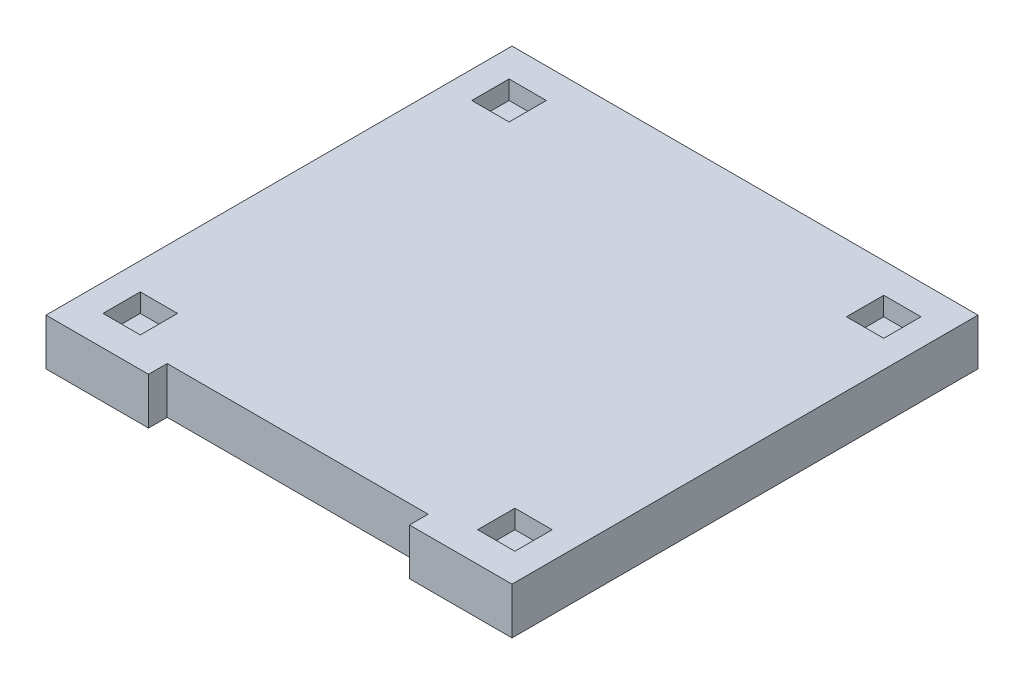
ISO-10303-21;
HEADER;
FILE_DESCRIPTION(('STEP AP214'),'2;1');
FILE_NAME('part.step','',(''),(''),'','','');
FILE_SCHEMA(('AUTOMOTIVE_DESIGN { 1 0 10303 214 1 1 1 1 }'));
ENDSEC;
DATA;
#1=APPLICATION_CONTEXT('core data for automotive mechanical design processes');
#2=APPLICATION_PROTOCOL_DEFINITION('international standard','automotive_design',2000,#1);
#3=PRODUCT_CONTEXT('',#1,'mechanical');
#4=PRODUCT('Part','Part','',(#3));
#5=PRODUCT_RELATED_PRODUCT_CATEGORY('part','',(#4));
#6=PRODUCT_DEFINITION_FORMATION('','',#4);
#7=PRODUCT_DEFINITION_CONTEXT('part definition',#1,'design');
#8=PRODUCT_DEFINITION('design','',#6,#7);
#9=PRODUCT_DEFINITION_SHAPE('','',#8);
#10=(LENGTH_UNIT() NAMED_UNIT(*) SI_UNIT(.MILLI.,.METRE.));
#11=(NAMED_UNIT(*) PLANE_ANGLE_UNIT() SI_UNIT($,.RADIAN.));
#12=(NAMED_UNIT(*) SI_UNIT($,.STERADIAN.) SOLID_ANGLE_UNIT());
#13=UNCERTAINTY_MEASURE_WITH_UNIT(LENGTH_MEASURE(1.E-05),#10,'distance_accuracy_value','');
#14=(GEOMETRIC_REPRESENTATION_CONTEXT(3) GLOBAL_UNCERTAINTY_ASSIGNED_CONTEXT((#13)) GLOBAL_UNIT_ASSIGNED_CONTEXT((#10,
#11,#12)) REPRESENTATION_CONTEXT('',''));
#15=CARTESIAN_POINT('',(0.,0.,0.));
#16=DIRECTION('',(0.,0.,1.));
#17=DIRECTION('',(1.,0.,0.));
#18=AXIS2_PLACEMENT_3D('',#15,#16,#17);
#19=CARTESIAN_POINT('',(-1249.99999999995,250.,1250.00000000003));
#20=DIRECTION('',(0.,0.,-1.));
#21=DIRECTION('',(-1.,0.,0.));
#22=AXIS2_PLACEMENT_3D('',#19,#20,#21);
#23=PLANE('',#22);
#24=DIRECTION('',(1.,0.,0.));
#25=VECTOR('',#24,1.);
#26=CARTESIAN_POINT('',(-1249.99999999995,250.,1250.00000000003));
#27=LINE('',#26,#25);
#28=CARTESIAN_POINT('',(700.,250.,1250.00000000003));
#29=VERTEX_POINT('',#28);
#30=CARTESIAN_POINT('',(1249.99999999995,250.,1250.00000000003));
#31=VERTEX_POINT('',#30);
#32=EDGE_CURVE('E244',#29,#31,#27,.T.);
#33=ORIENTED_EDGE('',*,*,#32,.F.);
#34=DIRECTION('',(0.,1.,0.));
#35=VECTOR('',#34,1.);
#36=CARTESIAN_POINT('',(700.,0.,1250.00000000003));
#37=LINE('',#36,#35);
#38=CARTESIAN_POINT('',(700.,0.,1250.00000000003));
#39=VERTEX_POINT('',#38);
#40=EDGE_CURVE('E202',#39,#29,#37,.T.);
#41=ORIENTED_EDGE('',*,*,#40,.F.);
#42=DIRECTION('',(1.,0.,0.));
#43=VECTOR('',#42,1.);
#44=CARTESIAN_POINT('',(-1249.99999999995,0.,1250.00000000003));
#45=LINE('',#44,#43);
#46=CARTESIAN_POINT('',(1249.99999999995,0.,1250.00000000003));
#47=VERTEX_POINT('',#46);
#48=EDGE_CURVE('E220',#39,#47,#45,.T.);
#49=ORIENTED_EDGE('',*,*,#48,.T.);
#50=DIRECTION('',(0.,-1.,0.));
#51=VECTOR('',#50,1.);
#52=CARTESIAN_POINT('',(1249.99999999995,250.,1250.00000000003));
#53=LINE('',#52,#51);
#54=EDGE_CURVE('E228',#31,#47,#53,.T.);
#55=ORIENTED_EDGE('',*,*,#54,.F.);
#56=EDGE_LOOP('',(#33,#41,#49,#55));
#57=FACE_BOUND('',#56,.T.);
#58=ADVANCED_FACE('F34',(#57),#23,.F.);
#59=CARTESIAN_POINT('',(0.,250.,0.));
#60=DIRECTION('',(0.,-1.,0.));
#61=DIRECTION('',(0.,0.,-1.));
#62=AXIS2_PLACEMENT_3D('',#59,#60,#61);
#63=PLANE('',#62);
#64=DIRECTION('',(1.,0.,0.));
#65=VECTOR('',#64,1.);
#66=CARTESIAN_POINT('',(-904.982787162382,250.,-889.328544111955));
#67=LINE('',#66,#65);
#68=CARTESIAN_POINT('',(-1104.98278716238,250.,-889.328544111955));
#69=VERTEX_POINT('',#68);
#70=CARTESIAN_POINT('',(-904.982787162382,250.,-889.328544111955));
#71=VERTEX_POINT('',#70);
#72=EDGE_CURVE('E446',#69,#71,#67,.T.);
#73=ORIENTED_EDGE('',*,*,#72,.F.);
#74=DIRECTION('',(0.,0.,1.));
#75=VECTOR('',#74,1.);
#76=CARTESIAN_POINT('',(-1104.98278716238,250.,-889.328544111955));
#77=LINE('',#76,#75);
#78=CARTESIAN_POINT('',(-1104.98278716238,250.,-1089.32854411195));
#79=VERTEX_POINT('',#78);
#80=EDGE_CURVE('E59',#79,#69,#77,.T.);
#81=ORIENTED_EDGE('',*,*,#80,.F.);
#82=DIRECTION('',(-1.,0.,0.));
#83=VECTOR('',#82,1.);
#84=CARTESIAN_POINT('',(-1104.98278716238,250.,-1089.32854411195));
#85=LINE('',#84,#83);
#86=CARTESIAN_POINT('',(-904.982787162382,250.,-1089.32854411195));
#87=VERTEX_POINT('',#86);
#88=EDGE_CURVE('E435',#87,#79,#85,.T.);
#89=ORIENTED_EDGE('',*,*,#88,.F.);
#90=DIRECTION('',(0.,0.,-1.));
#91=VECTOR('',#90,1.);
#92=CARTESIAN_POINT('',(-904.982787162382,250.,-1089.32854411195));
#93=LINE('',#92,#91);
#94=EDGE_CURVE('E449',#71,#87,#93,.T.);
#95=ORIENTED_EDGE('',*,*,#94,.F.);
#96=EDGE_LOOP('',(#73,#81,#89,#95));
#97=FACE_BOUND('',#96,.T.);
#98=DIRECTION('',(-1.,0.,0.));
#99=VECTOR('',#98,1.);
#100=CARTESIAN_POINT('',(-1104.98278716238,250.,889.328544111954));
#101=LINE('',#100,#99);
#102=CARTESIAN_POINT('',(-904.982787162382,250.,889.328544111954));
#103=VERTEX_POINT('',#102);
#104=CARTESIAN_POINT('',(-1104.98278716238,250.,889.328544111954));
#105=VERTEX_POINT('',#104);
#106=EDGE_CURVE('E413',#103,#105,#101,.T.);
#107=ORIENTED_EDGE('',*,*,#106,.F.);
#108=DIRECTION('',(0.,0.,-1.));
#109=VECTOR('',#108,1.);
#110=CARTESIAN_POINT('',(-904.982787162382,250.,889.328544111954));
#111=LINE('',#110,#109);
#112=CARTESIAN_POINT('',(-904.982787162382,250.,1089.32854411195));
#113=VERTEX_POINT('',#112);
#114=EDGE_CURVE('E411',#113,#103,#111,.T.);
#115=ORIENTED_EDGE('',*,*,#114,.F.);
#116=DIRECTION('',(1.,0.,0.));
#117=VECTOR('',#116,1.);
#118=CARTESIAN_POINT('',(-904.982787162382,250.,1089.32854411195));
#119=LINE('',#118,#117);
#120=CARTESIAN_POINT('',(-1104.98278716238,250.,1089.32854411195));
#121=VERTEX_POINT('',#120);
#122=EDGE_CURVE('E401',#121,#113,#119,.T.);
#123=ORIENTED_EDGE('',*,*,#122,.F.);
#124=DIRECTION('',(0.,0.,1.));
#125=VECTOR('',#124,1.);
#126=CARTESIAN_POINT('',(-1104.98278716238,250.,1089.32854411195));
#127=LINE('',#126,#125);
#128=EDGE_CURVE('E417',#105,#121,#127,.T.);
#129=ORIENTED_EDGE('',*,*,#128,.F.);
#130=EDGE_LOOP('',(#107,#115,#123,#129));
#131=FACE_BOUND('',#130,.T.);
#132=DIRECTION('',(-1.,0.,0.));
#133=VECTOR('',#132,1.);
#134=CARTESIAN_POINT('',(-700.,250.,1150.00000000003));
#135=LINE('',#134,#133);
#136=CARTESIAN_POINT('',(700.,250.,1150.00000000003));
#137=VERTEX_POINT('',#136);
#138=CARTESIAN_POINT('',(-700.,250.,1150.00000000003));
#139=VERTEX_POINT('',#138);
#140=EDGE_CURVE('E389',#137,#139,#135,.T.);
#141=ORIENTED_EDGE('',*,*,#140,.F.);
#142=DIRECTION('',(0.,0.,-1.));
#143=VECTOR('',#142,1.);
#144=CARTESIAN_POINT('',(700.,250.,1150.00000000003));
#145=LINE('',#144,#143);
#146=EDGE_CURVE('E274',#29,#137,#145,.T.);
#147=ORIENTED_EDGE('',*,*,#146,.F.);
#148=ORIENTED_EDGE('',*,*,#32,.T.);
#149=DIRECTION('',(0.,0.,1.));
#150=VECTOR('',#149,1.);
#151=CARTESIAN_POINT('',(1249.99999999995,250.,-1250.00000000003));
#152=LINE('',#151,#150);
#153=CARTESIAN_POINT('',(1249.99999999995,250.,-1250.00000000003));
#154=VERTEX_POINT('',#153);
#155=EDGE_CURVE('E266',#154,#31,#152,.T.);
#156=ORIENTED_EDGE('',*,*,#155,.F.);
#157=DIRECTION('',(1.,0.,0.));
#158=VECTOR('',#157,1.);
#159=CARTESIAN_POINT('',(-1249.99999999995,250.,-1250.00000000003));
#160=LINE('',#159,#158);
#161=CARTESIAN_POINT('',(-1249.99999999995,250.,-1250.00000000003));
#162=VERTEX_POINT('',#161);
#163=EDGE_CURVE('E222',#162,#154,#160,.T.);
#164=ORIENTED_EDGE('',*,*,#163,.F.);
#165=DIRECTION('',(0.,0.,1.));
#166=VECTOR('',#165,1.);
#167=CARTESIAN_POINT('',(-1249.99999999995,250.,-1250.00000000003));
#168=LINE('',#167,#166);
#169=CARTESIAN_POINT('',(-1249.99999999995,250.,1250.00000000003));
#170=VERTEX_POINT('',#169);
#171=EDGE_CURVE('E235',#162,#170,#168,.T.);
#172=ORIENTED_EDGE('',*,*,#171,.T.);
#173=CARTESIAN_POINT('',(-700.,250.,1250.00000000003));
#174=VERTEX_POINT('',#173);
#175=EDGE_CURVE('E239',#170,#174,#27,.T.);
#176=ORIENTED_EDGE('',*,*,#175,.T.);
#177=DIRECTION('',(0.,0.,1.));
#178=VECTOR('',#177,1.);
#179=CARTESIAN_POINT('',(-700.,250.,1150.00000000003));
#180=LINE('',#179,#178);
#181=EDGE_CURVE('E197',#139,#174,#180,.T.);
#182=ORIENTED_EDGE('',*,*,#181,.F.);
#183=EDGE_LOOP('',(#141,#147,#148,#156,#164,#172,#176,#182));
#184=FACE_BOUND('',#183,.T.);
#185=DIRECTION('',(-1.,0.,0.));
#186=VECTOR('',#185,1.);
#187=CARTESIAN_POINT('',(1104.98278716238,250.,889.328544111954));
#188=LINE('',#187,#186);
#189=CARTESIAN_POINT('',(1104.98278716238,250.,889.328544111954));
#190=VERTEX_POINT('',#189);
#191=CARTESIAN_POINT('',(904.982787162382,250.,889.328544111954));
#192=VERTEX_POINT('',#191);
#193=EDGE_CURVE('E501',#190,#192,#188,.T.);
#194=ORIENTED_EDGE('',*,*,#193,.F.);
#195=DIRECTION('',(0.,0.,-1.));
#196=VECTOR('',#195,1.);
#197=CARTESIAN_POINT('',(1104.98278716238,250.,1089.32854411195));
#198=LINE('',#197,#196);
#199=CARTESIAN_POINT('',(1104.98278716238,250.,1089.32854411195));
#200=VERTEX_POINT('',#199);
#201=EDGE_CURVE('E490',#200,#190,#198,.T.);
#202=ORIENTED_EDGE('',*,*,#201,.F.);
#203=DIRECTION('',(-1.,0.,0.));
#204=VECTOR('',#203,1.);
#205=CARTESIAN_POINT('',(1104.98278716238,250.,1089.32854411195));
#206=LINE('',#205,#204);
#207=CARTESIAN_POINT('',(904.982787162382,250.,1089.32854411195));
#208=VERTEX_POINT('',#207);
#209=EDGE_CURVE('E258',#200,#208,#206,.T.);
#210=ORIENTED_EDGE('',*,*,#209,.T.);
#211=DIRECTION('',(0.,0.,-1.));
#212=VECTOR('',#211,1.);
#213=CARTESIAN_POINT('',(904.982787162382,250.,1089.32854411195));
#214=LINE('',#213,#212);
#215=EDGE_CURVE('E503',#208,#192,#214,.T.);
#216=ORIENTED_EDGE('',*,*,#215,.T.);
#217=EDGE_LOOP('',(#194,#202,#210,#216));
#218=FACE_BOUND('',#217,.T.);
#219=DIRECTION('',(0.,0.,-1.));
#220=VECTOR('',#219,1.);
#221=CARTESIAN_POINT('',(904.982787162382,250.,-889.328544111955));
#222=LINE('',#221,#220);
#223=CARTESIAN_POINT('',(904.982787162382,250.,-889.328544111955));
#224=VERTEX_POINT('',#223);
#225=CARTESIAN_POINT('',(904.982787162382,250.,-1089.32854411196));
#226=VERTEX_POINT('',#225);
#227=EDGE_CURVE('E424',#224,#226,#222,.T.);
#228=ORIENTED_EDGE('',*,*,#227,.T.);
#229=DIRECTION('',(1.,0.,0.));
#230=VECTOR('',#229,1.);
#231=CARTESIAN_POINT('',(904.982787162382,250.,-1089.32854411196));
#232=LINE('',#231,#230);
#233=CARTESIAN_POINT('',(1104.98278716238,250.,-1089.32854411196));
#234=VERTEX_POINT('',#233);
#235=EDGE_CURVE('E473',#226,#234,#232,.T.);
#236=ORIENTED_EDGE('',*,*,#235,.T.);
#237=DIRECTION('',(0.,0.,1.));
#238=VECTOR('',#237,1.);
#239=CARTESIAN_POINT('',(1104.98278716238,250.,-1089.32854411196));
#240=LINE('',#239,#238);
#241=CARTESIAN_POINT('',(1104.98278716238,250.,-889.328544111955));
#242=VERTEX_POINT('',#241);
#243=EDGE_CURVE('E476',#234,#242,#240,.T.);
#244=ORIENTED_EDGE('',*,*,#243,.T.);
#245=DIRECTION('',(-1.,0.,0.));
#246=VECTOR('',#245,1.);
#247=CARTESIAN_POINT('',(1104.98278716238,250.,-889.328544111955));
#248=LINE('',#247,#246);
#249=EDGE_CURVE('E464',#242,#224,#248,.T.);
#250=ORIENTED_EDGE('',*,*,#249,.T.);
#251=EDGE_LOOP('',(#228,#236,#244,#250));
#252=FACE_BOUND('',#251,.T.);
#253=ADVANCED_FACE('F271',(#97,#131,#184,#218,#252),#63,.F.);
#254=CARTESIAN_POINT('',(-1249.99999999995,250.,-1250.00000000003));
#255=DIRECTION('',(0.,0.,-1.));
#256=DIRECTION('',(-1.,0.,0.));
#257=AXIS2_PLACEMENT_3D('',#254,#255,#256);
#258=PLANE('',#257);
#259=DIRECTION('',(1.,0.,0.));
#260=VECTOR('',#259,1.);
#261=CARTESIAN_POINT('',(-1249.99999999995,0.,-1250.00000000003));
#262=LINE('',#261,#260);
#263=CARTESIAN_POINT('',(-1249.99999999995,0.,-1250.00000000003));
#264=VERTEX_POINT('',#263);
#265=CARTESIAN_POINT('',(1249.99999999995,0.,-1250.00000000003));
#266=VERTEX_POINT('',#265);
#267=EDGE_CURVE('E247',#264,#266,#262,.T.);
#268=ORIENTED_EDGE('',*,*,#267,.F.);
#269=DIRECTION('',(0.,-1.,0.));
#270=VECTOR('',#269,1.);
#271=CARTESIAN_POINT('',(-1249.99999999995,250.,-1250.00000000003));
#272=LINE('',#271,#270);
#273=EDGE_CURVE('E11',#162,#264,#272,.T.);
#274=ORIENTED_EDGE('',*,*,#273,.F.);
#275=ORIENTED_EDGE('',*,*,#163,.T.);
#276=DIRECTION('',(0.,-1.,0.));
#277=VECTOR('',#276,1.);
#278=CARTESIAN_POINT('',(1249.99999999995,250.,-1250.00000000003));
#279=LINE('',#278,#277);
#280=EDGE_CURVE('E38',#154,#266,#279,.T.);
#281=ORIENTED_EDGE('',*,*,#280,.T.);
#282=EDGE_LOOP('',(#268,#274,#275,#281));
#283=FACE_BOUND('',#282,.T.);
#284=ADVANCED_FACE('F36',(#283),#258,.T.);
#285=CARTESIAN_POINT('',(-1249.99999999995,250.,-1250.00000000003));
#286=DIRECTION('',(1.,0.,0.));
#287=DIRECTION('',(0.,0.,-1.));
#288=AXIS2_PLACEMENT_3D('',#285,#286,#287);
#289=PLANE('',#288);
#290=DIRECTION('',(0.,0.,1.));
#291=VECTOR('',#290,1.);
#292=CARTESIAN_POINT('',(-1249.99999999995,0.,-1250.00000000003));
#293=LINE('',#292,#291);
#294=CARTESIAN_POINT('',(-1249.99999999995,0.,1250.00000000003));
#295=VERTEX_POINT('',#294);
#296=EDGE_CURVE('E219',#264,#295,#293,.T.);
#297=ORIENTED_EDGE('',*,*,#296,.T.);
#298=DIRECTION('',(0.,-1.,0.));
#299=VECTOR('',#298,1.);
#300=CARTESIAN_POINT('',(-1249.99999999995,250.,1250.00000000003));
#301=LINE('',#300,#299);
#302=EDGE_CURVE('E43',#170,#295,#301,.T.);
#303=ORIENTED_EDGE('',*,*,#302,.F.);
#304=ORIENTED_EDGE('',*,*,#171,.F.);
#305=ORIENTED_EDGE('',*,*,#273,.T.);
#306=EDGE_LOOP('',(#297,#303,#304,#305));
#307=FACE_BOUND('',#306,.T.);
#308=ADVANCED_FACE('F286',(#307),#289,.F.);
#309=CARTESIAN_POINT('',(-700.,0.,1250.00000000003));
#310=VERTEX_POINT('',#309);
#311=EDGE_CURVE('E211',#295,#310,#45,.T.);
#312=ORIENTED_EDGE('',*,*,#311,.T.);
#313=DIRECTION('',(0.,1.,0.));
#314=VECTOR('',#313,1.);
#315=CARTESIAN_POINT('',(-700.,0.,1250.00000000003));
#316=LINE('',#315,#314);
#317=EDGE_CURVE('E194',#310,#174,#316,.T.);
#318=ORIENTED_EDGE('',*,*,#317,.T.);
#319=ORIENTED_EDGE('',*,*,#175,.F.);
#320=ORIENTED_EDGE('',*,*,#302,.T.);
#321=EDGE_LOOP('',(#312,#318,#319,#320));
#322=FACE_BOUND('',#321,.T.);
#323=ADVANCED_FACE('F217',(#322),#23,.F.);
#324=CARTESIAN_POINT('',(1249.99999999995,250.,-1250.00000000003));
#325=DIRECTION('',(1.,0.,0.));
#326=DIRECTION('',(0.,0.,-1.));
#327=AXIS2_PLACEMENT_3D('',#324,#325,#326);
#328=PLANE('',#327);
#329=DIRECTION('',(0.,0.,1.));
#330=VECTOR('',#329,1.);
#331=CARTESIAN_POINT('',(1249.99999999995,0.,-1250.00000000003));
#332=LINE('',#331,#330);
#333=EDGE_CURVE('E224',#266,#47,#332,.T.);
#334=ORIENTED_EDGE('',*,*,#333,.F.);
#335=ORIENTED_EDGE('',*,*,#280,.F.);
#336=ORIENTED_EDGE('',*,*,#155,.T.);
#337=ORIENTED_EDGE('',*,*,#54,.T.);
#338=EDGE_LOOP('',(#334,#335,#336,#337));
#339=FACE_BOUND('',#338,.T.);
#340=ADVANCED_FACE('F278',(#339),#328,.T.);
#341=CARTESIAN_POINT('',(0.,0.,0.));
#342=DIRECTION('',(0.,-1.,0.));
#343=DIRECTION('',(0.,0.,-1.));
#344=AXIS2_PLACEMENT_3D('',#341,#342,#343);
#345=PLANE('',#344);
#346=DIRECTION('',(0.,0.,-1.));
#347=VECTOR('',#346,1.);
#348=CARTESIAN_POINT('',(700.,0.,1150.00000000003));
#349=LINE('',#348,#347);
#350=CARTESIAN_POINT('',(700.,0.,1150.00000000003));
#351=VERTEX_POINT('',#350);
#352=EDGE_CURVE('E214',#39,#351,#349,.T.);
#353=ORIENTED_EDGE('',*,*,#352,.T.);
#354=DIRECTION('',(-1.,0.,0.));
#355=VECTOR('',#354,1.);
#356=CARTESIAN_POINT('',(0.,0.,1150.00000000003));
#357=LINE('',#356,#355);
#358=CARTESIAN_POINT('',(-700.,0.,1150.00000000003));
#359=VERTEX_POINT('',#358);
#360=EDGE_CURVE('E213',#351,#359,#357,.T.);
#361=ORIENTED_EDGE('',*,*,#360,.T.);
#362=DIRECTION('',(0.,0.,1.));
#363=VECTOR('',#362,1.);
#364=CARTESIAN_POINT('',(-700.,0.,1150.00000000003));
#365=LINE('',#364,#363);
#366=EDGE_CURVE('E51',#359,#310,#365,.T.);
#367=ORIENTED_EDGE('',*,*,#366,.T.);
#368=ORIENTED_EDGE('',*,*,#311,.F.);
#369=ORIENTED_EDGE('',*,*,#296,.F.);
#370=ORIENTED_EDGE('',*,*,#267,.T.);
#371=ORIENTED_EDGE('',*,*,#333,.T.);
#372=ORIENTED_EDGE('',*,*,#48,.F.);
#373=EDGE_LOOP('',(#353,#361,#367,#368,#369,#370,#371,#372));
#374=FACE_BOUND('',#373,.T.);
#375=ADVANCED_FACE('F209',(#374),#345,.T.);
#376=CARTESIAN_POINT('',(1104.98278716238,150.,1089.32854411195));
#377=DIRECTION('',(1.,0.,0.));
#378=DIRECTION('',(0.,0.,-1.));
#379=AXIS2_PLACEMENT_3D('',#376,#377,#378);
#380=PLANE('',#379);
#381=ORIENTED_EDGE('',*,*,#201,.T.);
#382=DIRECTION('',(0.,1.,0.));
#383=VECTOR('',#382,1.);
#384=CARTESIAN_POINT('',(1104.98278716238,150.,889.328544111954));
#385=LINE('',#384,#383);
#386=CARTESIAN_POINT('',(1104.98278716238,150.,889.328544111954));
#387=VERTEX_POINT('',#386);
#388=EDGE_CURVE('E262',#387,#190,#385,.T.);
#389=ORIENTED_EDGE('',*,*,#388,.F.);
#390=DIRECTION('',(0.,0.,-1.));
#391=VECTOR('',#390,1.);
#392=CARTESIAN_POINT('',(1104.98278716238,150.,1089.32854411195));
#393=LINE('',#392,#391);
#394=CARTESIAN_POINT('',(1104.98278716238,150.,1089.32854411195));
#395=VERTEX_POINT('',#394);
#396=EDGE_CURVE('E491',#395,#387,#393,.T.);
#397=ORIENTED_EDGE('',*,*,#396,.F.);
#398=DIRECTION('',(0.,1.,0.));
#399=VECTOR('',#398,1.);
#400=CARTESIAN_POINT('',(1104.98278716238,150.,1089.32854411195));
#401=LINE('',#400,#399);
#402=EDGE_CURVE('E249',#395,#200,#401,.T.);
#403=ORIENTED_EDGE('',*,*,#402,.T.);
#404=EDGE_LOOP('',(#381,#389,#397,#403));
#405=FACE_BOUND('',#404,.T.);
#406=ADVANCED_FACE('F284',(#405),#380,.F.);
#407=CARTESIAN_POINT('',(1104.98278716238,150.,1089.32854411195));
#408=DIRECTION('',(0.,0.,-1.));
#409=DIRECTION('',(-1.,0.,0.));
#410=AXIS2_PLACEMENT_3D('',#407,#408,#409);
#411=PLANE('',#410);
#412=ORIENTED_EDGE('',*,*,#209,.F.);
#413=ORIENTED_EDGE('',*,*,#402,.F.);
#414=DIRECTION('',(-1.,0.,0.));
#415=VECTOR('',#414,1.);
#416=CARTESIAN_POINT('',(1104.98278716238,150.,1089.32854411195));
#417=LINE('',#416,#415);
#418=CARTESIAN_POINT('',(904.982787162382,150.,1089.32854411195));
#419=VERTEX_POINT('',#418);
#420=EDGE_CURVE('E265',#395,#419,#417,.T.);
#421=ORIENTED_EDGE('',*,*,#420,.T.);
#422=DIRECTION('',(0.,1.,0.));
#423=VECTOR('',#422,1.);
#424=CARTESIAN_POINT('',(904.982787162382,150.,1089.32854411195));
#425=LINE('',#424,#423);
#426=EDGE_CURVE('E250',#419,#208,#425,.T.);
#427=ORIENTED_EDGE('',*,*,#426,.T.);
#428=EDGE_LOOP('',(#412,#413,#421,#427));
#429=FACE_BOUND('',#428,.T.);
#430=ADVANCED_FACE('F300',(#429),#411,.T.);
#431=CARTESIAN_POINT('',(904.982787162382,150.,1089.32854411195));
#432=DIRECTION('',(1.,0.,0.));
#433=DIRECTION('',(0.,0.,-1.));
#434=AXIS2_PLACEMENT_3D('',#431,#432,#433);
#435=PLANE('',#434);
#436=ORIENTED_EDGE('',*,*,#215,.F.);
#437=ORIENTED_EDGE('',*,*,#426,.F.);
#438=DIRECTION('',(0.,0.,-1.));
#439=VECTOR('',#438,1.);
#440=CARTESIAN_POINT('',(904.982787162382,150.,1089.32854411195));
#441=LINE('',#440,#439);
#442=CARTESIAN_POINT('',(904.982787162382,150.,889.328544111954));
#443=VERTEX_POINT('',#442);
#444=EDGE_CURVE('E497',#419,#443,#441,.T.);
#445=ORIENTED_EDGE('',*,*,#444,.T.);
#446=DIRECTION('',(0.,1.,0.));
#447=VECTOR('',#446,1.);
#448=CARTESIAN_POINT('',(904.982787162382,150.,889.328544111954));
#449=LINE('',#448,#447);
#450=EDGE_CURVE('E255',#443,#192,#449,.T.);
#451=ORIENTED_EDGE('',*,*,#450,.T.);
#452=EDGE_LOOP('',(#436,#437,#445,#451));
#453=FACE_BOUND('',#452,.T.);
#454=ADVANCED_FACE('F305',(#453),#435,.T.);
#455=CARTESIAN_POINT('',(1104.98278716238,150.,889.328544111954));
#456=DIRECTION('',(0.,0.,-1.));
#457=DIRECTION('',(-1.,0.,0.));
#458=AXIS2_PLACEMENT_3D('',#455,#456,#457);
#459=PLANE('',#458);
#460=ORIENTED_EDGE('',*,*,#193,.T.);
#461=ORIENTED_EDGE('',*,*,#450,.F.);
#462=DIRECTION('',(-1.,0.,0.));
#463=VECTOR('',#462,1.);
#464=CARTESIAN_POINT('',(1104.98278716238,150.,889.328544111954));
#465=LINE('',#464,#463);
#466=EDGE_CURVE('E494',#387,#443,#465,.T.);
#467=ORIENTED_EDGE('',*,*,#466,.F.);
#468=ORIENTED_EDGE('',*,*,#388,.T.);
#469=EDGE_LOOP('',(#460,#461,#467,#468));
#470=FACE_BOUND('',#469,.T.);
#471=ADVANCED_FACE('F301',(#470),#459,.F.);
#472=CARTESIAN_POINT('',(0.,150.,0.));
#473=DIRECTION('',(0.,1.,0.));
#474=DIRECTION('',(0.,0.,1.));
#475=AXIS2_PLACEMENT_3D('',#472,#473,#474);
#476=PLANE('',#475);
#477=ORIENTED_EDGE('',*,*,#396,.T.);
#478=ORIENTED_EDGE('',*,*,#466,.T.);
#479=ORIENTED_EDGE('',*,*,#444,.F.);
#480=ORIENTED_EDGE('',*,*,#420,.F.);
#481=EDGE_LOOP('',(#477,#478,#479,#480));
#482=FACE_BOUND('',#481,.T.);
#483=ADVANCED_FACE('F304',(#482),#476,.T.);
#484=CARTESIAN_POINT('',(904.982787162382,150.,-889.328544111955));
#485=DIRECTION('',(1.,0.,0.));
#486=DIRECTION('',(0.,0.,-1.));
#487=AXIS2_PLACEMENT_3D('',#484,#485,#486);
#488=PLANE('',#487);
#489=ORIENTED_EDGE('',*,*,#227,.F.);
#490=DIRECTION('',(0.,1.,0.));
#491=VECTOR('',#490,1.);
#492=CARTESIAN_POINT('',(904.982787162382,150.,-889.328544111955));
#493=LINE('',#492,#491);
#494=CARTESIAN_POINT('',(904.982787162382,150.,-889.328544111955));
#495=VERTEX_POINT('',#494);
#496=EDGE_CURVE('E470',#495,#224,#493,.T.);
#497=ORIENTED_EDGE('',*,*,#496,.F.);
#498=DIRECTION('',(0.,0.,-1.));
#499=VECTOR('',#498,1.);
#500=CARTESIAN_POINT('',(904.982787162382,150.,-889.328544111955));
#501=LINE('',#500,#499);
#502=CARTESIAN_POINT('',(904.982787162382,150.,-1089.32854411196));
#503=VERTEX_POINT('',#502);
#504=EDGE_CURVE('E460',#495,#503,#501,.T.);
#505=ORIENTED_EDGE('',*,*,#504,.T.);
#506=DIRECTION('',(0.,1.,0.));
#507=VECTOR('',#506,1.);
#508=CARTESIAN_POINT('',(904.982787162382,150.,-1089.32854411196));
#509=LINE('',#508,#507);
#510=EDGE_CURVE('E487',#503,#226,#509,.T.);
#511=ORIENTED_EDGE('',*,*,#510,.T.);
#512=EDGE_LOOP('',(#489,#497,#505,#511));
#513=FACE_BOUND('',#512,.T.);
#514=ADVANCED_FACE('F315',(#513),#488,.T.);
#515=CARTESIAN_POINT('',(904.982787162382,150.,-1089.32854411196));
#516=DIRECTION('',(0.,0.,1.));
#517=DIRECTION('',(1.,0.,0.));
#518=AXIS2_PLACEMENT_3D('',#515,#516,#517);
#519=PLANE('',#518);
#520=ORIENTED_EDGE('',*,*,#235,.F.);
#521=ORIENTED_EDGE('',*,*,#510,.F.);
#522=DIRECTION('',(1.,0.,0.));
#523=VECTOR('',#522,1.);
#524=CARTESIAN_POINT('',(904.982787162382,150.,-1089.32854411196));
#525=LINE('',#524,#523);
#526=CARTESIAN_POINT('',(1104.98278716238,150.,-1089.32854411196));
#527=VERTEX_POINT('',#526);
#528=EDGE_CURVE('E463',#503,#527,#525,.T.);
#529=ORIENTED_EDGE('',*,*,#528,.T.);
#530=DIRECTION('',(0.,1.,0.));
#531=VECTOR('',#530,1.);
#532=CARTESIAN_POINT('',(1104.98278716238,150.,-1089.32854411196));
#533=LINE('',#532,#531);
#534=EDGE_CURVE('E485',#527,#234,#533,.T.);
#535=ORIENTED_EDGE('',*,*,#534,.T.);
#536=EDGE_LOOP('',(#520,#521,#529,#535));
#537=FACE_BOUND('',#536,.T.);
#538=ADVANCED_FACE('F319',(#537),#519,.T.);
#539=CARTESIAN_POINT('',(1104.98278716238,150.,-1089.32854411196));
#540=DIRECTION('',(-1.,0.,0.));
#541=DIRECTION('',(0.,0.,1.));
#542=AXIS2_PLACEMENT_3D('',#539,#540,#541);
#543=PLANE('',#542);
#544=ORIENTED_EDGE('',*,*,#243,.F.);
#545=ORIENTED_EDGE('',*,*,#534,.F.);
#546=DIRECTION('',(0.,0.,1.));
#547=VECTOR('',#546,1.);
#548=CARTESIAN_POINT('',(1104.98278716238,150.,-1089.32854411196));
#549=LINE('',#548,#547);
#550=CARTESIAN_POINT('',(1104.98278716238,150.,-889.328544111955));
#551=VERTEX_POINT('',#550);
#552=EDGE_CURVE('E466',#527,#551,#549,.T.);
#553=ORIENTED_EDGE('',*,*,#552,.T.);
#554=DIRECTION('',(0.,1.,0.));
#555=VECTOR('',#554,1.);
#556=CARTESIAN_POINT('',(1104.98278716238,150.,-889.328544111955));
#557=LINE('',#556,#555);
#558=EDGE_CURVE('E483',#551,#242,#557,.T.);
#559=ORIENTED_EDGE('',*,*,#558,.T.);
#560=EDGE_LOOP('',(#544,#545,#553,#559));
#561=FACE_BOUND('',#560,.T.);
#562=ADVANCED_FACE('F323',(#561),#543,.T.);
#563=CARTESIAN_POINT('',(1104.98278716238,150.,-889.328544111955));
#564=DIRECTION('',(0.,0.,-1.));
#565=DIRECTION('',(-1.,0.,0.));
#566=AXIS2_PLACEMENT_3D('',#563,#564,#565);
#567=PLANE('',#566);
#568=ORIENTED_EDGE('',*,*,#249,.F.);
#569=ORIENTED_EDGE('',*,*,#558,.F.);
#570=DIRECTION('',(-1.,0.,0.));
#571=VECTOR('',#570,1.);
#572=CARTESIAN_POINT('',(1104.98278716238,150.,-889.328544111955));
#573=LINE('',#572,#571);
#574=EDGE_CURVE('E468',#551,#495,#573,.T.);
#575=ORIENTED_EDGE('',*,*,#574,.T.);
#576=ORIENTED_EDGE('',*,*,#496,.T.);
#577=EDGE_LOOP('',(#568,#569,#575,#576));
#578=FACE_BOUND('',#577,.T.);
#579=ADVANCED_FACE('F327',(#578),#567,.T.);
#580=CARTESIAN_POINT('',(0.,150.,0.));
#581=DIRECTION('',(0.,-1.,0.));
#582=DIRECTION('',(0.,0.,-1.));
#583=AXIS2_PLACEMENT_3D('',#580,#581,#582);
#584=PLANE('',#583);
#585=ORIENTED_EDGE('',*,*,#504,.F.);
#586=ORIENTED_EDGE('',*,*,#574,.F.);
#587=ORIENTED_EDGE('',*,*,#552,.F.);
#588=ORIENTED_EDGE('',*,*,#528,.F.);
#589=EDGE_LOOP('',(#585,#586,#587,#588));
#590=FACE_BOUND('',#589,.T.);
#591=ADVANCED_FACE('F331',(#590),#584,.F.);
#592=CARTESIAN_POINT('',(-904.982787162382,150.,889.328544111954));
#593=DIRECTION('',(1.,0.,0.));
#594=DIRECTION('',(0.,0.,-1.));
#595=AXIS2_PLACEMENT_3D('',#592,#593,#594);
#596=PLANE('',#595);
#597=ORIENTED_EDGE('',*,*,#114,.T.);
#598=DIRECTION('',(0.,1.,0.));
#599=VECTOR('',#598,1.);
#600=CARTESIAN_POINT('',(-904.982787162382,150.,889.328544111954));
#601=LINE('',#600,#599);
#602=CARTESIAN_POINT('',(-904.982787162382,150.,889.328544111954));
#603=VERTEX_POINT('',#602);
#604=EDGE_CURVE('E410',#603,#103,#601,.T.);
#605=ORIENTED_EDGE('',*,*,#604,.F.);
#606=DIRECTION('',(0.,0.,-1.));
#607=VECTOR('',#606,1.);
#608=CARTESIAN_POINT('',(-904.982787162382,150.,889.328544111954));
#609=LINE('',#608,#607);
#610=CARTESIAN_POINT('',(-904.982787162382,150.,1089.32854411195));
#611=VERTEX_POINT('',#610);
#612=EDGE_CURVE('E397',#611,#603,#609,.T.);
#613=ORIENTED_EDGE('',*,*,#612,.F.);
#614=DIRECTION('',(0.,1.,0.));
#615=VECTOR('',#614,1.);
#616=CARTESIAN_POINT('',(-904.982787162382,150.,1089.32854411195));
#617=LINE('',#616,#615);
#618=EDGE_CURVE('E422',#611,#113,#617,.T.);
#619=ORIENTED_EDGE('',*,*,#618,.T.);
#620=EDGE_LOOP('',(#597,#605,#613,#619));
#621=FACE_BOUND('',#620,.T.);
#622=ADVANCED_FACE('F335',(#621),#596,.F.);
#623=CARTESIAN_POINT('',(-904.982787162382,150.,1089.32854411195));
#624=DIRECTION('',(0.,0.,1.));
#625=DIRECTION('',(1.,0.,0.));
#626=AXIS2_PLACEMENT_3D('',#623,#624,#625);
#627=PLANE('',#626);
#628=ORIENTED_EDGE('',*,*,#122,.T.);
#629=ORIENTED_EDGE('',*,*,#618,.F.);
#630=DIRECTION('',(1.,0.,0.));
#631=VECTOR('',#630,1.);
#632=CARTESIAN_POINT('',(-904.982787162382,150.,1089.32854411195));
#633=LINE('',#632,#631);
#634=CARTESIAN_POINT('',(-1104.98278716238,150.,1089.32854411195));
#635=VERTEX_POINT('',#634);
#636=EDGE_CURVE('E407',#635,#611,#633,.T.);
#637=ORIENTED_EDGE('',*,*,#636,.F.);
#638=DIRECTION('',(0.,1.,0.));
#639=VECTOR('',#638,1.);
#640=CARTESIAN_POINT('',(-1104.98278716238,150.,1089.32854411195));
#641=LINE('',#640,#639);
#642=EDGE_CURVE('E425',#635,#121,#641,.T.);
#643=ORIENTED_EDGE('',*,*,#642,.T.);
#644=EDGE_LOOP('',(#628,#629,#637,#643));
#645=FACE_BOUND('',#644,.T.);
#646=ADVANCED_FACE('F360',(#645),#627,.F.);
#647=CARTESIAN_POINT('',(-1104.98278716238,150.,1089.32854411195));
#648=DIRECTION('',(-1.,0.,0.));
#649=DIRECTION('',(0.,0.,1.));
#650=AXIS2_PLACEMENT_3D('',#647,#648,#649);
#651=PLANE('',#650);
#652=ORIENTED_EDGE('',*,*,#128,.T.);
#653=ORIENTED_EDGE('',*,*,#642,.F.);
#654=DIRECTION('',(0.,0.,1.));
#655=VECTOR('',#654,1.);
#656=CARTESIAN_POINT('',(-1104.98278716238,150.,1089.32854411195));
#657=LINE('',#656,#655);
#658=CARTESIAN_POINT('',(-1104.98278716238,150.,889.328544111954));
#659=VERTEX_POINT('',#658);
#660=EDGE_CURVE('E404',#659,#635,#657,.T.);
#661=ORIENTED_EDGE('',*,*,#660,.F.);
#662=DIRECTION('',(0.,1.,0.));
#663=VECTOR('',#662,1.);
#664=CARTESIAN_POINT('',(-1104.98278716238,150.,889.328544111954));
#665=LINE('',#664,#663);
#666=EDGE_CURVE('E427',#659,#105,#665,.T.);
#667=ORIENTED_EDGE('',*,*,#666,.T.);
#668=EDGE_LOOP('',(#652,#653,#661,#667));
#669=FACE_BOUND('',#668,.T.);
#670=ADVANCED_FACE('F365',(#669),#651,.F.);
#671=CARTESIAN_POINT('',(-1104.98278716238,150.,889.328544111954));
#672=DIRECTION('',(0.,0.,-1.));
#673=DIRECTION('',(-1.,0.,0.));
#674=AXIS2_PLACEMENT_3D('',#671,#672,#673);
#675=PLANE('',#674);
#676=ORIENTED_EDGE('',*,*,#106,.T.);
#677=ORIENTED_EDGE('',*,*,#666,.F.);
#678=DIRECTION('',(-1.,0.,0.));
#679=VECTOR('',#678,1.);
#680=CARTESIAN_POINT('',(-1104.98278716238,150.,889.328544111954));
#681=LINE('',#680,#679);
#682=EDGE_CURVE('E400',#603,#659,#681,.T.);
#683=ORIENTED_EDGE('',*,*,#682,.F.);
#684=ORIENTED_EDGE('',*,*,#604,.T.);
#685=EDGE_LOOP('',(#676,#677,#683,#684));
#686=FACE_BOUND('',#685,.T.);
#687=ADVANCED_FACE('F362',(#686),#675,.F.);
#688=CARTESIAN_POINT('',(0.,150.,0.));
#689=DIRECTION('',(0.,-1.,0.));
#690=DIRECTION('',(0.,0.,-1.));
#691=AXIS2_PLACEMENT_3D('',#688,#689,#690);
#692=PLANE('',#691);
#693=ORIENTED_EDGE('',*,*,#612,.T.);
#694=ORIENTED_EDGE('',*,*,#682,.T.);
#695=ORIENTED_EDGE('',*,*,#660,.T.);
#696=ORIENTED_EDGE('',*,*,#636,.T.);
#697=EDGE_LOOP('',(#693,#694,#695,#696));
#698=FACE_BOUND('',#697,.T.);
#699=ADVANCED_FACE('F341',(#698),#692,.F.);
#700=CARTESIAN_POINT('',(-1104.98278716238,150.,-889.328544111955));
#701=DIRECTION('',(-1.,0.,0.));
#702=DIRECTION('',(0.,0.,1.));
#703=AXIS2_PLACEMENT_3D('',#700,#701,#702);
#704=PLANE('',#703);
#705=ORIENTED_EDGE('',*,*,#80,.T.);
#706=DIRECTION('',(0.,1.,0.));
#707=VECTOR('',#706,1.);
#708=CARTESIAN_POINT('',(-1104.98278716238,150.,-889.328544111955));
#709=LINE('',#708,#707);
#710=CARTESIAN_POINT('',(-1104.98278716238,150.,-889.328544111955));
#711=VERTEX_POINT('',#710);
#712=EDGE_CURVE('E444',#711,#69,#709,.T.);
#713=ORIENTED_EDGE('',*,*,#712,.F.);
#714=DIRECTION('',(0.,0.,1.));
#715=VECTOR('',#714,1.);
#716=CARTESIAN_POINT('',(-1104.98278716238,150.,-889.328544111955));
#717=LINE('',#716,#715);
#718=CARTESIAN_POINT('',(-1104.98278716238,150.,-1089.32854411195));
#719=VERTEX_POINT('',#718);
#720=EDGE_CURVE('E431',#719,#711,#717,.T.);
#721=ORIENTED_EDGE('',*,*,#720,.F.);
#722=DIRECTION('',(0.,1.,0.));
#723=VECTOR('',#722,1.);
#724=CARTESIAN_POINT('',(-1104.98278716238,150.,-1089.32854411195));
#725=LINE('',#724,#723);
#726=EDGE_CURVE('E414',#719,#79,#725,.T.);
#727=ORIENTED_EDGE('',*,*,#726,.T.);
#728=EDGE_LOOP('',(#705,#713,#721,#727));
#729=FACE_BOUND('',#728,.T.);
#730=ADVANCED_FACE('F337',(#729),#704,.F.);
#731=CARTESIAN_POINT('',(-1104.98278716238,150.,-1089.32854411195));
#732=DIRECTION('',(0.,0.,-1.));
#733=DIRECTION('',(-1.,0.,0.));
#734=AXIS2_PLACEMENT_3D('',#731,#732,#733);
#735=PLANE('',#734);
#736=ORIENTED_EDGE('',*,*,#88,.T.);
#737=ORIENTED_EDGE('',*,*,#726,.F.);
#738=DIRECTION('',(-1.,0.,0.));
#739=VECTOR('',#738,1.);
#740=CARTESIAN_POINT('',(-1104.98278716238,150.,-1089.32854411195));
#741=LINE('',#740,#739);
#742=CARTESIAN_POINT('',(-904.982787162382,150.,-1089.32854411195));
#743=VERTEX_POINT('',#742);
#744=EDGE_CURVE('E441',#743,#719,#741,.T.);
#745=ORIENTED_EDGE('',*,*,#744,.F.);
#746=DIRECTION('',(0.,1.,0.));
#747=VECTOR('',#746,1.);
#748=CARTESIAN_POINT('',(-904.982787162382,150.,-1089.32854411195));
#749=LINE('',#748,#747);
#750=EDGE_CURVE('E455',#743,#87,#749,.T.);
#751=ORIENTED_EDGE('',*,*,#750,.T.);
#752=EDGE_LOOP('',(#736,#737,#745,#751));
#753=FACE_BOUND('',#752,.T.);
#754=ADVANCED_FACE('F340',(#753),#735,.F.);
#755=CARTESIAN_POINT('',(-904.982787162382,150.,-1089.32854411195));
#756=DIRECTION('',(1.,0.,0.));
#757=DIRECTION('',(0.,0.,-1.));
#758=AXIS2_PLACEMENT_3D('',#755,#756,#757);
#759=PLANE('',#758);
#760=ORIENTED_EDGE('',*,*,#94,.T.);
#761=ORIENTED_EDGE('',*,*,#750,.F.);
#762=DIRECTION('',(0.,0.,-1.));
#763=VECTOR('',#762,1.);
#764=CARTESIAN_POINT('',(-904.982787162382,150.,-1089.32854411195));
#765=LINE('',#764,#763);
#766=CARTESIAN_POINT('',(-904.982787162382,150.,-889.328544111955));
#767=VERTEX_POINT('',#766);
#768=EDGE_CURVE('E438',#767,#743,#765,.T.);
#769=ORIENTED_EDGE('',*,*,#768,.F.);
#770=DIRECTION('',(0.,1.,0.));
#771=VECTOR('',#770,1.);
#772=CARTESIAN_POINT('',(-904.982787162382,150.,-889.328544111955));
#773=LINE('',#772,#771);
#774=EDGE_CURVE('E457',#767,#71,#773,.T.);
#775=ORIENTED_EDGE('',*,*,#774,.T.);
#776=EDGE_LOOP('',(#760,#761,#769,#775));
#777=FACE_BOUND('',#776,.T.);
#778=ADVANCED_FACE('F346',(#777),#759,.F.);
#779=CARTESIAN_POINT('',(-904.982787162382,150.,-889.328544111955));
#780=DIRECTION('',(0.,0.,1.));
#781=DIRECTION('',(1.,0.,0.));
#782=AXIS2_PLACEMENT_3D('',#779,#780,#781);
#783=PLANE('',#782);
#784=ORIENTED_EDGE('',*,*,#72,.T.);
#785=ORIENTED_EDGE('',*,*,#774,.F.);
#786=DIRECTION('',(1.,0.,0.));
#787=VECTOR('',#786,1.);
#788=CARTESIAN_POINT('',(-904.982787162382,150.,-889.328544111955));
#789=LINE('',#788,#787);
#790=EDGE_CURVE('E434',#711,#767,#789,.T.);
#791=ORIENTED_EDGE('',*,*,#790,.F.);
#792=ORIENTED_EDGE('',*,*,#712,.T.);
#793=EDGE_LOOP('',(#784,#785,#791,#792));
#794=FACE_BOUND('',#793,.T.);
#795=ADVANCED_FACE('F342',(#794),#783,.F.);
#796=CARTESIAN_POINT('',(0.,150.,0.));
#797=DIRECTION('',(0.,-1.,0.));
#798=DIRECTION('',(0.,0.,-1.));
#799=AXIS2_PLACEMENT_3D('',#796,#797,#798);
#800=PLANE('',#799);
#801=ORIENTED_EDGE('',*,*,#720,.T.);
#802=ORIENTED_EDGE('',*,*,#790,.T.);
#803=ORIENTED_EDGE('',*,*,#768,.T.);
#804=ORIENTED_EDGE('',*,*,#744,.T.);
#805=EDGE_LOOP('',(#801,#802,#803,#804));
#806=FACE_BOUND('',#805,.T.);
#807=ADVANCED_FACE('F345',(#806),#800,.F.);
#808=CARTESIAN_POINT('',(700.,0.,1150.00000000003));
#809=DIRECTION('',(1.,0.,0.));
#810=DIRECTION('',(0.,0.,-1.));
#811=AXIS2_PLACEMENT_3D('',#808,#809,#810);
#812=PLANE('',#811);
#813=ORIENTED_EDGE('',*,*,#146,.T.);
#814=DIRECTION('',(0.,1.,0.));
#815=VECTOR('',#814,1.);
#816=CARTESIAN_POINT('',(700.,0.,1150.00000000003));
#817=LINE('',#816,#815);
#818=EDGE_CURVE('E386',#351,#137,#817,.T.);
#819=ORIENTED_EDGE('',*,*,#818,.F.);
#820=ORIENTED_EDGE('',*,*,#352,.F.);
#821=ORIENTED_EDGE('',*,*,#40,.T.);
#822=EDGE_LOOP('',(#813,#819,#820,#821));
#823=FACE_BOUND('',#822,.T.);
#824=ADVANCED_FACE('F356',(#823),#812,.F.);
#825=CARTESIAN_POINT('',(-700.,0.,1150.00000000003));
#826=DIRECTION('',(-1.,0.,0.));
#827=DIRECTION('',(0.,0.,1.));
#828=AXIS2_PLACEMENT_3D('',#825,#826,#827);
#829=PLANE('',#828);
#830=ORIENTED_EDGE('',*,*,#181,.T.);
#831=ORIENTED_EDGE('',*,*,#317,.F.);
#832=ORIENTED_EDGE('',*,*,#366,.F.);
#833=DIRECTION('',(0.,1.,0.));
#834=VECTOR('',#833,1.);
#835=CARTESIAN_POINT('',(-700.,0.,1150.00000000003));
#836=LINE('',#835,#834);
#837=EDGE_CURVE('E203',#359,#139,#836,.T.);
#838=ORIENTED_EDGE('',*,*,#837,.T.);
#839=EDGE_LOOP('',(#830,#831,#832,#838));
#840=FACE_BOUND('',#839,.T.);
#841=ADVANCED_FACE('F195',(#840),#829,.F.);
#842=CARTESIAN_POINT('',(-700.,0.,1150.00000000003));
#843=DIRECTION('',(0.,0.,-1.));
#844=DIRECTION('',(-1.,0.,0.));
#845=AXIS2_PLACEMENT_3D('',#842,#843,#844);
#846=PLANE('',#845);
#847=ORIENTED_EDGE('',*,*,#140,.T.);
#848=ORIENTED_EDGE('',*,*,#837,.F.);
#849=ORIENTED_EDGE('',*,*,#360,.F.);
#850=ORIENTED_EDGE('',*,*,#818,.T.);
#851=EDGE_LOOP('',(#847,#848,#849,#850));
#852=FACE_BOUND('',#851,.T.);
#853=ADVANCED_FACE('F376',(#852),#846,.F.);
#854=CLOSED_SHELL('',(#58,#253,#284,#308,#323,#340,#375,#406,#430,#454,#471,#483,#514,#538,#562,
#579,#591,#622,#646,#670,#687,#699,#730,#754,#778,#795,#807,#824,#841,#853));
#855=MANIFOLD_SOLID_BREP('B2',#854);
#856=ADVANCED_BREP_SHAPE_REPRESENTATION('',(#18,#855),#14);
#857=SHAPE_DEFINITION_REPRESENTATION(#9,#856);
ENDSEC;
END-ISO-10303-21;
